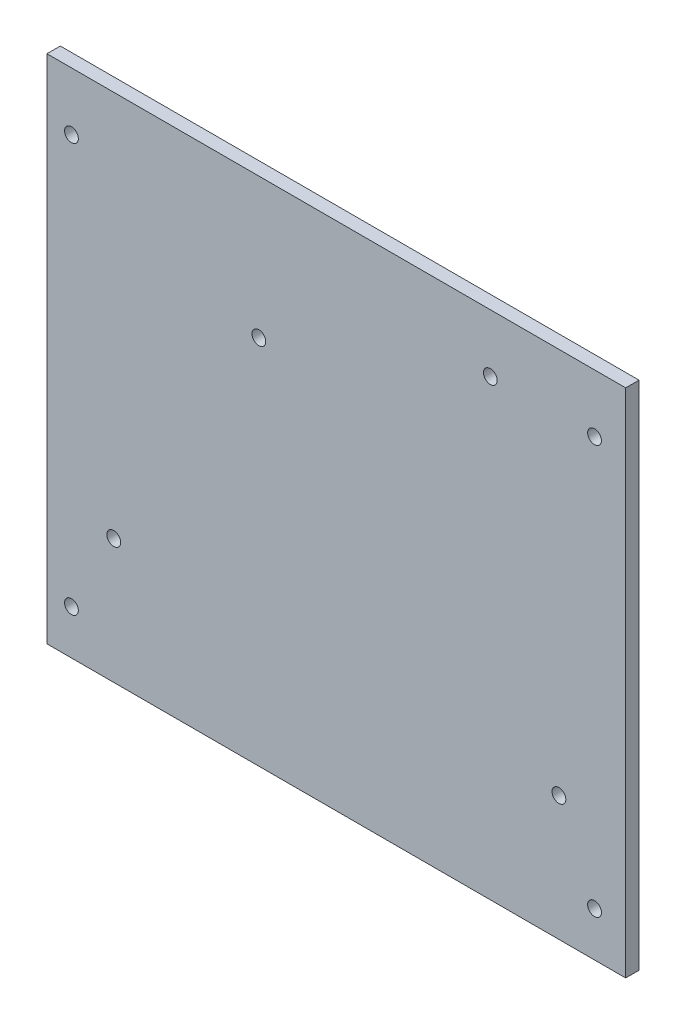
ISO-10303-21;
HEADER;
FILE_DESCRIPTION(('STEP AP214'),'2;1');
FILE_NAME('part.step','',(''),(''),'','','');
FILE_SCHEMA(('AUTOMOTIVE_DESIGN { 1 0 10303 214 1 1 1 1 }'));
ENDSEC;
DATA;
#1=APPLICATION_CONTEXT('core data for automotive mechanical design processes');
#2=APPLICATION_PROTOCOL_DEFINITION('international standard','automotive_design',2000,#1);
#3=PRODUCT_CONTEXT('',#1,'mechanical');
#4=PRODUCT('Part','Part','',(#3));
#5=PRODUCT_RELATED_PRODUCT_CATEGORY('part','',(#4));
#6=PRODUCT_DEFINITION_FORMATION('','',#4);
#7=PRODUCT_DEFINITION_CONTEXT('part definition',#1,'design');
#8=PRODUCT_DEFINITION('design','',#6,#7);
#9=PRODUCT_DEFINITION_SHAPE('','',#8);
#10=(LENGTH_UNIT() NAMED_UNIT(*) SI_UNIT(.MILLI.,.METRE.));
#11=(NAMED_UNIT(*) PLANE_ANGLE_UNIT() SI_UNIT($,.RADIAN.));
#12=(NAMED_UNIT(*) SI_UNIT($,.STERADIAN.) SOLID_ANGLE_UNIT());
#13=UNCERTAINTY_MEASURE_WITH_UNIT(LENGTH_MEASURE(1.E-05),#10,'distance_accuracy_value','');
#14=(GEOMETRIC_REPRESENTATION_CONTEXT(3) GLOBAL_UNCERTAINTY_ASSIGNED_CONTEXT((#13)) GLOBAL_UNIT_ASSIGNED_CONTEXT((#10,
#11,#12)) REPRESENTATION_CONTEXT('',''));
#15=CARTESIAN_POINT('',(0.,0.,0.));
#16=DIRECTION('',(0.,0.,1.));
#17=DIRECTION('',(1.,0.,0.));
#18=AXIS2_PLACEMENT_3D('',#15,#16,#17);
#19=CARTESIAN_POINT('',(0.,0.,3.));
#20=DIRECTION('',(0.,0.,-1.));
#21=DIRECTION('',(-1.,0.,0.));
#22=AXIS2_PLACEMENT_3D('',#19,#20,#21);
#23=PLANE('',#22);
#24=CARTESIAN_POINT('',(34.6,44.4,3.));
#25=DIRECTION('',(0.,0.,-1.));
#26=DIRECTION('',(-1.,0.,0.));
#27=AXIS2_PLACEMENT_3D('',#24,#25,#26);
#28=CIRCLE('',#27,1.55);
#29=CARTESIAN_POINT('',(33.05,44.4,3.));
#30=VERTEX_POINT('',#29);
#31=EDGE_CURVE('E142',#30,#30,#28,.F.);
#32=ORIENTED_EDGE('',*,*,#31,.F.);
#33=EDGE_LOOP('',(#32));
#34=FACE_BOUND('',#33,.T.);
#35=CARTESIAN_POINT('',(-17.4,25.96,3.));
#36=DIRECTION('',(0.,0.,-1.));
#37=DIRECTION('',(-1.,0.,0.));
#38=AXIS2_PLACEMENT_3D('',#35,#36,#37);
#39=CIRCLE('',#38,1.55);
#40=CARTESIAN_POINT('',(-18.95,25.96,3.));
#41=VERTEX_POINT('',#40);
#42=EDGE_CURVE('E147',#41,#41,#39,.F.);
#43=ORIENTED_EDGE('',*,*,#42,.F.);
#44=EDGE_LOOP('',(#43));
#45=FACE_BOUND('',#44,.T.);
#46=CARTESIAN_POINT('',(50.,-29.4,3.));
#47=DIRECTION('',(0.,0.,-1.));
#48=DIRECTION('',(-1.,0.,0.));
#49=AXIS2_PLACEMENT_3D('',#46,#47,#48);
#50=CIRCLE('',#49,1.54999999999999);
#51=CARTESIAN_POINT('',(48.45,-29.4,3.));
#52=VERTEX_POINT('',#51);
#53=EDGE_CURVE('E132',#52,#52,#50,.F.);
#54=ORIENTED_EDGE('',*,*,#53,.F.);
#55=EDGE_LOOP('',(#54));
#56=FACE_BOUND('',#55,.T.);
#57=CARTESIAN_POINT('',(-50.,-29.4,3.));
#58=DIRECTION('',(0.,0.,-1.));
#59=DIRECTION('',(-1.,0.,0.));
#60=AXIS2_PLACEMENT_3D('',#57,#58,#59);
#61=CIRCLE('',#60,1.54999999999999);
#62=CARTESIAN_POINT('',(-51.55,-29.4,3.));
#63=VERTEX_POINT('',#62);
#64=EDGE_CURVE('E135',#63,#63,#61,.F.);
#65=ORIENTED_EDGE('',*,*,#64,.F.);
#66=EDGE_LOOP('',(#65));
#67=FACE_BOUND('',#66,.T.);
#68=DIRECTION('',(0.,1.,0.));
#69=VECTOR('',#68,1.);
#70=CARTESIAN_POINT('',(65.,-57.4,3.));
#71=LINE('',#70,#69);
#72=CARTESIAN_POINT('',(65.,-57.4,3.));
#73=VERTEX_POINT('',#72);
#74=CARTESIAN_POINT('',(65.,57.4,3.));
#75=VERTEX_POINT('',#74);
#76=EDGE_CURVE('E84',#73,#75,#71,.T.);
#77=ORIENTED_EDGE('',*,*,#76,.T.);
#78=DIRECTION('',(-1.,0.,0.));
#79=VECTOR('',#78,1.);
#80=CARTESIAN_POINT('',(-65.,57.4,3.));
#81=LINE('',#80,#79);
#82=CARTESIAN_POINT('',(-65.,57.4,3.));
#83=VERTEX_POINT('',#82);
#84=EDGE_CURVE('E79',#75,#83,#81,.T.);
#85=ORIENTED_EDGE('',*,*,#84,.T.);
#86=DIRECTION('',(0.,-1.,0.));
#87=VECTOR('',#86,1.);
#88=CARTESIAN_POINT('',(-65.,-57.4,3.));
#89=LINE('',#88,#87);
#90=CARTESIAN_POINT('',(-65.,-57.4,3.));
#91=VERTEX_POINT('',#90);
#92=EDGE_CURVE('E82',#83,#91,#89,.T.);
#93=ORIENTED_EDGE('',*,*,#92,.T.);
#94=DIRECTION('',(1.,0.,0.));
#95=VECTOR('',#94,1.);
#96=CARTESIAN_POINT('',(-65.,-57.4,3.));
#97=LINE('',#96,#95);
#98=EDGE_CURVE('E49',#91,#73,#97,.T.);
#99=ORIENTED_EDGE('',*,*,#98,.T.);
#100=EDGE_LOOP('',(#77,#85,#93,#99));
#101=FACE_BOUND('',#100,.T.);
#102=CARTESIAN_POINT('',(-59.5,44.4,3.));
#103=DIRECTION('',(0.,0.,1.));
#104=DIRECTION('',(1.,0.,0.));
#105=AXIS2_PLACEMENT_3D('',#102,#103,#104);
#106=CIRCLE('',#105,1.55);
#107=CARTESIAN_POINT('',(-57.95,44.4,3.));
#108=VERTEX_POINT('',#107);
#109=EDGE_CURVE('E99',#108,#108,#106,.T.);
#110=ORIENTED_EDGE('',*,*,#109,.F.);
#111=EDGE_LOOP('',(#110));
#112=FACE_BOUND('',#111,.T.);
#113=CARTESIAN_POINT('',(58.,44.4,3.));
#114=DIRECTION('',(0.,0.,1.));
#115=DIRECTION('',(1.,0.,0.));
#116=AXIS2_PLACEMENT_3D('',#113,#114,#115);
#117=CIRCLE('',#116,1.55);
#118=CARTESIAN_POINT('',(59.55,44.4,3.));
#119=VERTEX_POINT('',#118);
#120=EDGE_CURVE('E114',#119,#119,#117,.T.);
#121=ORIENTED_EDGE('',*,*,#120,.F.);
#122=EDGE_LOOP('',(#121));
#123=FACE_BOUND('',#122,.T.);
#124=CARTESIAN_POINT('',(58.,-47.4,3.));
#125=DIRECTION('',(0.,0.,1.));
#126=DIRECTION('',(1.,0.,0.));
#127=AXIS2_PLACEMENT_3D('',#124,#125,#126);
#128=CIRCLE('',#127,1.55);
#129=CARTESIAN_POINT('',(59.55,-47.4,3.));
#130=VERTEX_POINT('',#129);
#131=EDGE_CURVE('E120',#130,#130,#128,.T.);
#132=ORIENTED_EDGE('',*,*,#131,.F.);
#133=EDGE_LOOP('',(#132));
#134=FACE_BOUND('',#133,.T.);
#135=CARTESIAN_POINT('',(-59.5,-47.4,3.));
#136=DIRECTION('',(0.,0.,1.));
#137=DIRECTION('',(1.,0.,0.));
#138=AXIS2_PLACEMENT_3D('',#135,#136,#137);
#139=CIRCLE('',#138,1.55);
#140=CARTESIAN_POINT('',(-57.95,-47.4,3.));
#141=VERTEX_POINT('',#140);
#142=EDGE_CURVE('E126',#141,#141,#139,.T.);
#143=ORIENTED_EDGE('',*,*,#142,.F.);
#144=EDGE_LOOP('',(#143));
#145=FACE_BOUND('',#144,.T.);
#146=ADVANCED_FACE('F32',(#34,#45,#56,#67,#101,#112,#123,#134,#145),#23,.F.);
#147=CARTESIAN_POINT('',(0.,0.,0.));
#148=DIRECTION('',(0.,0.,-1.));
#149=DIRECTION('',(-1.,0.,0.));
#150=AXIS2_PLACEMENT_3D('',#147,#148,#149);
#151=PLANE('',#150);
#152=CARTESIAN_POINT('',(34.6,44.4,0.));
#153=DIRECTION('',(0.,0.,-1.));
#154=DIRECTION('',(-1.,0.,0.));
#155=AXIS2_PLACEMENT_3D('',#152,#153,#154);
#156=CIRCLE('',#155,1.55);
#157=CARTESIAN_POINT('',(33.05,44.4,0.));
#158=VERTEX_POINT('',#157);
#159=EDGE_CURVE('E150',#158,#158,#156,.T.);
#160=ORIENTED_EDGE('',*,*,#159,.F.);
#161=EDGE_LOOP('',(#160));
#162=FACE_BOUND('',#161,.T.);
#163=CARTESIAN_POINT('',(-17.4,25.96,0.));
#164=DIRECTION('',(0.,0.,-1.));
#165=DIRECTION('',(-1.,0.,0.));
#166=AXIS2_PLACEMENT_3D('',#163,#164,#165);
#167=CIRCLE('',#166,1.55);
#168=CARTESIAN_POINT('',(-18.95,25.96,0.));
#169=VERTEX_POINT('',#168);
#170=EDGE_CURVE('E151',#169,#169,#167,.T.);
#171=ORIENTED_EDGE('',*,*,#170,.F.);
#172=EDGE_LOOP('',(#171));
#173=FACE_BOUND('',#172,.T.);
#174=CARTESIAN_POINT('',(50.,-29.4,0.));
#175=DIRECTION('',(0.,0.,-1.));
#176=DIRECTION('',(-1.,0.,0.));
#177=AXIS2_PLACEMENT_3D('',#174,#175,#176);
#178=CIRCLE('',#177,1.54999999999999);
#179=CARTESIAN_POINT('',(48.45,-29.4,0.));
#180=VERTEX_POINT('',#179);
#181=EDGE_CURVE('E138',#180,#180,#178,.T.);
#182=ORIENTED_EDGE('',*,*,#181,.F.);
#183=EDGE_LOOP('',(#182));
#184=FACE_BOUND('',#183,.T.);
#185=CARTESIAN_POINT('',(-50.,-29.4,0.));
#186=DIRECTION('',(0.,0.,-1.));
#187=DIRECTION('',(-1.,0.,0.));
#188=AXIS2_PLACEMENT_3D('',#185,#186,#187);
#189=CIRCLE('',#188,1.54999999999999);
#190=CARTESIAN_POINT('',(-51.55,-29.4,0.));
#191=VERTEX_POINT('',#190);
#192=EDGE_CURVE('E139',#191,#191,#189,.T.);
#193=ORIENTED_EDGE('',*,*,#192,.F.);
#194=EDGE_LOOP('',(#193));
#195=FACE_BOUND('',#194,.T.);
#196=CARTESIAN_POINT('',(58.,-47.4,0.));
#197=DIRECTION('',(0.,0.,1.));
#198=DIRECTION('',(1.,0.,0.));
#199=AXIS2_PLACEMENT_3D('',#196,#197,#198);
#200=CIRCLE('',#199,1.55);
#201=CARTESIAN_POINT('',(59.55,-47.4,0.));
#202=VERTEX_POINT('',#201);
#203=EDGE_CURVE('E123',#202,#202,#200,.T.);
#204=ORIENTED_EDGE('',*,*,#203,.T.);
#205=EDGE_LOOP('',(#204));
#206=FACE_BOUND('',#205,.T.);
#207=CARTESIAN_POINT('',(-59.5,44.4,0.));
#208=DIRECTION('',(0.,0.,1.));
#209=DIRECTION('',(1.,0.,0.));
#210=AXIS2_PLACEMENT_3D('',#207,#208,#209);
#211=CIRCLE('',#210,1.55);
#212=CARTESIAN_POINT('',(-57.95,44.4,0.));
#213=VERTEX_POINT('',#212);
#214=EDGE_CURVE('E111',#213,#213,#211,.T.);
#215=ORIENTED_EDGE('',*,*,#214,.T.);
#216=EDGE_LOOP('',(#215));
#217=FACE_BOUND('',#216,.T.);
#218=DIRECTION('',(0.,1.,0.));
#219=VECTOR('',#218,1.);
#220=CARTESIAN_POINT('',(65.,-57.4,0.));
#221=LINE('',#220,#219);
#222=CARTESIAN_POINT('',(65.,-57.4,0.));
#223=VERTEX_POINT('',#222);
#224=CARTESIAN_POINT('',(65.,57.4,0.));
#225=VERTEX_POINT('',#224);
#226=EDGE_CURVE('E96',#223,#225,#221,.T.);
#227=ORIENTED_EDGE('',*,*,#226,.F.);
#228=DIRECTION('',(1.,0.,0.));
#229=VECTOR('',#228,1.);
#230=CARTESIAN_POINT('',(-65.,-57.4,0.));
#231=LINE('',#230,#229);
#232=CARTESIAN_POINT('',(-65.,-57.4,0.));
#233=VERTEX_POINT('',#232);
#234=EDGE_CURVE('E72',#233,#223,#231,.T.);
#235=ORIENTED_EDGE('',*,*,#234,.F.);
#236=DIRECTION('',(0.,-1.,0.));
#237=VECTOR('',#236,1.);
#238=CARTESIAN_POINT('',(-65.,-57.4,0.));
#239=LINE('',#238,#237);
#240=CARTESIAN_POINT('',(-65.,57.4,0.));
#241=VERTEX_POINT('',#240);
#242=EDGE_CURVE('E66',#241,#233,#239,.T.);
#243=ORIENTED_EDGE('',*,*,#242,.F.);
#244=DIRECTION('',(-1.,0.,0.));
#245=VECTOR('',#244,1.);
#246=CARTESIAN_POINT('',(-65.,57.4,0.));
#247=LINE('',#246,#245);
#248=EDGE_CURVE('E88',#225,#241,#247,.T.);
#249=ORIENTED_EDGE('',*,*,#248,.F.);
#250=EDGE_LOOP('',(#227,#235,#243,#249));
#251=FACE_BOUND('',#250,.T.);
#252=CARTESIAN_POINT('',(58.,44.4,0.));
#253=DIRECTION('',(0.,0.,1.));
#254=DIRECTION('',(1.,0.,0.));
#255=AXIS2_PLACEMENT_3D('',#252,#253,#254);
#256=CIRCLE('',#255,1.55);
#257=CARTESIAN_POINT('',(59.55,44.4,0.));
#258=VERTEX_POINT('',#257);
#259=EDGE_CURVE('E117',#258,#258,#256,.T.);
#260=ORIENTED_EDGE('',*,*,#259,.T.);
#261=EDGE_LOOP('',(#260));
#262=FACE_BOUND('',#261,.T.);
#263=CARTESIAN_POINT('',(-59.5,-47.4,0.));
#264=DIRECTION('',(0.,0.,1.));
#265=DIRECTION('',(1.,0.,0.));
#266=AXIS2_PLACEMENT_3D('',#263,#264,#265);
#267=CIRCLE('',#266,1.55);
#268=CARTESIAN_POINT('',(-57.95,-47.4,0.));
#269=VERTEX_POINT('',#268);
#270=EDGE_CURVE('E129',#269,#269,#267,.T.);
#271=ORIENTED_EDGE('',*,*,#270,.T.);
#272=EDGE_LOOP('',(#271));
#273=FACE_BOUND('',#272,.T.);
#274=ADVANCED_FACE('F107',(#162,#173,#184,#195,#206,#217,#251,#262,#273),#151,.T.);
#275=CARTESIAN_POINT('',(65.,-57.4,3.));
#276=DIRECTION('',(-1.,0.,0.));
#277=DIRECTION('',(0.,0.,1.));
#278=AXIS2_PLACEMENT_3D('',#275,#276,#277);
#279=PLANE('',#278);
#280=ORIENTED_EDGE('',*,*,#226,.T.);
#281=DIRECTION('',(0.,0.,-1.));
#282=VECTOR('',#281,1.);
#283=CARTESIAN_POINT('',(65.,57.4,3.));
#284=LINE('',#283,#282);
#285=EDGE_CURVE('E11',#75,#225,#284,.T.);
#286=ORIENTED_EDGE('',*,*,#285,.F.);
#287=ORIENTED_EDGE('',*,*,#76,.F.);
#288=DIRECTION('',(0.,0.,-1.));
#289=VECTOR('',#288,1.);
#290=CARTESIAN_POINT('',(65.,-57.4,3.));
#291=LINE('',#290,#289);
#292=EDGE_CURVE('E92',#73,#223,#291,.T.);
#293=ORIENTED_EDGE('',*,*,#292,.T.);
#294=EDGE_LOOP('',(#280,#286,#287,#293));
#295=FACE_BOUND('',#294,.T.);
#296=ADVANCED_FACE('F34',(#295),#279,.F.);
#297=CARTESIAN_POINT('',(-65.,57.4,3.));
#298=DIRECTION('',(0.,-1.,0.));
#299=DIRECTION('',(0.,0.,-1.));
#300=AXIS2_PLACEMENT_3D('',#297,#298,#299);
#301=PLANE('',#300);
#302=ORIENTED_EDGE('',*,*,#248,.T.);
#303=DIRECTION('',(0.,0.,-1.));
#304=VECTOR('',#303,1.);
#305=CARTESIAN_POINT('',(-65.,57.4,3.));
#306=LINE('',#305,#304);
#307=EDGE_CURVE('E41',#83,#241,#306,.T.);
#308=ORIENTED_EDGE('',*,*,#307,.F.);
#309=ORIENTED_EDGE('',*,*,#84,.F.);
#310=ORIENTED_EDGE('',*,*,#285,.T.);
#311=EDGE_LOOP('',(#302,#308,#309,#310));
#312=FACE_BOUND('',#311,.T.);
#313=ADVANCED_FACE('F87',(#312),#301,.F.);
#314=CARTESIAN_POINT('',(-65.,-57.4,3.));
#315=DIRECTION('',(1.,0.,0.));
#316=DIRECTION('',(0.,0.,-1.));
#317=AXIS2_PLACEMENT_3D('',#314,#315,#316);
#318=PLANE('',#317);
#319=ORIENTED_EDGE('',*,*,#242,.T.);
#320=DIRECTION('',(0.,0.,-1.));
#321=VECTOR('',#320,1.);
#322=CARTESIAN_POINT('',(-65.,-57.4,3.));
#323=LINE('',#322,#321);
#324=EDGE_CURVE('E89',#91,#233,#323,.T.);
#325=ORIENTED_EDGE('',*,*,#324,.F.);
#326=ORIENTED_EDGE('',*,*,#92,.F.);
#327=ORIENTED_EDGE('',*,*,#307,.T.);
#328=EDGE_LOOP('',(#319,#325,#326,#327));
#329=FACE_BOUND('',#328,.T.);
#330=ADVANCED_FACE('F90',(#329),#318,.F.);
#331=CARTESIAN_POINT('',(-65.,-57.4,3.));
#332=DIRECTION('',(0.,1.,0.));
#333=DIRECTION('',(0.,0.,1.));
#334=AXIS2_PLACEMENT_3D('',#331,#332,#333);
#335=PLANE('',#334);
#336=ORIENTED_EDGE('',*,*,#234,.T.);
#337=ORIENTED_EDGE('',*,*,#292,.F.);
#338=ORIENTED_EDGE('',*,*,#98,.F.);
#339=ORIENTED_EDGE('',*,*,#324,.T.);
#340=EDGE_LOOP('',(#336,#337,#338,#339));
#341=FACE_BOUND('',#340,.T.);
#342=ADVANCED_FACE('F104',(#341),#335,.F.);
#343=CARTESIAN_POINT('',(-59.5,44.4,3.));
#344=DIRECTION('',(0.,0.,-1.));
#345=DIRECTION('',(-1.,0.,0.));
#346=AXIS2_PLACEMENT_3D('',#343,#344,#345);
#347=CYLINDRICAL_SURFACE('',#346,1.55);
#348=ORIENTED_EDGE('',*,*,#109,.T.);
#349=EDGE_LOOP('',(#348));
#350=FACE_BOUND('',#349,.T.);
#351=ORIENTED_EDGE('',*,*,#214,.F.);
#352=EDGE_LOOP('',(#351));
#353=FACE_BOUND('',#352,.T.);
#354=ADVANCED_FACE('F175',(#350,#353),#347,.F.);
#355=CARTESIAN_POINT('',(58.,44.4,3.));
#356=DIRECTION('',(0.,0.,-1.));
#357=DIRECTION('',(-1.,0.,0.));
#358=AXIS2_PLACEMENT_3D('',#355,#356,#357);
#359=CYLINDRICAL_SURFACE('',#358,1.55);
#360=ORIENTED_EDGE('',*,*,#120,.T.);
#361=EDGE_LOOP('',(#360));
#362=FACE_BOUND('',#361,.T.);
#363=ORIENTED_EDGE('',*,*,#259,.F.);
#364=EDGE_LOOP('',(#363));
#365=FACE_BOUND('',#364,.T.);
#366=ADVANCED_FACE('F177',(#362,#365),#359,.F.);
#367=CARTESIAN_POINT('',(58.,-47.4,3.));
#368=DIRECTION('',(0.,0.,-1.));
#369=DIRECTION('',(-1.,0.,0.));
#370=AXIS2_PLACEMENT_3D('',#367,#368,#369);
#371=CYLINDRICAL_SURFACE('',#370,1.55);
#372=ORIENTED_EDGE('',*,*,#131,.T.);
#373=EDGE_LOOP('',(#372));
#374=FACE_BOUND('',#373,.T.);
#375=ORIENTED_EDGE('',*,*,#203,.F.);
#376=EDGE_LOOP('',(#375));
#377=FACE_BOUND('',#376,.T.);
#378=ADVANCED_FACE('F184',(#374,#377),#371,.F.);
#379=CARTESIAN_POINT('',(-59.5,-47.4,3.));
#380=DIRECTION('',(0.,0.,-1.));
#381=DIRECTION('',(-1.,0.,0.));
#382=AXIS2_PLACEMENT_3D('',#379,#380,#381);
#383=CYLINDRICAL_SURFACE('',#382,1.55);
#384=ORIENTED_EDGE('',*,*,#142,.T.);
#385=EDGE_LOOP('',(#384));
#386=FACE_BOUND('',#385,.T.);
#387=ORIENTED_EDGE('',*,*,#270,.F.);
#388=EDGE_LOOP('',(#387));
#389=FACE_BOUND('',#388,.T.);
#390=ADVANCED_FACE('F241',(#386,#389),#383,.F.);
#391=CARTESIAN_POINT('',(-50.,-29.4,3.001));
#392=DIRECTION('',(0.,0.,-1.));
#393=DIRECTION('',(-1.,0.,0.));
#394=AXIS2_PLACEMENT_3D('',#391,#392,#393);
#395=CYLINDRICAL_SURFACE('',#394,1.54999999999999);
#396=ORIENTED_EDGE('',*,*,#192,.T.);
#397=EDGE_LOOP('',(#396));
#398=FACE_BOUND('',#397,.T.);
#399=ORIENTED_EDGE('',*,*,#64,.T.);
#400=EDGE_LOOP('',(#399));
#401=FACE_BOUND('',#400,.T.);
#402=ADVANCED_FACE('F237',(#398,#401),#395,.F.);
#403=CARTESIAN_POINT('',(50.,-29.4,3.001));
#404=DIRECTION('',(0.,0.,-1.));
#405=DIRECTION('',(-1.,0.,0.));
#406=AXIS2_PLACEMENT_3D('',#403,#404,#405);
#407=CYLINDRICAL_SURFACE('',#406,1.54999999999999);
#408=ORIENTED_EDGE('',*,*,#181,.T.);
#409=EDGE_LOOP('',(#408));
#410=FACE_BOUND('',#409,.T.);
#411=ORIENTED_EDGE('',*,*,#53,.T.);
#412=EDGE_LOOP('',(#411));
#413=FACE_BOUND('',#412,.T.);
#414=ADVANCED_FACE('F220',(#410,#413),#407,.F.);
#415=CARTESIAN_POINT('',(-17.4,25.96,3.001));
#416=DIRECTION('',(0.,0.,-1.));
#417=DIRECTION('',(-1.,0.,0.));
#418=AXIS2_PLACEMENT_3D('',#415,#416,#417);
#419=CYLINDRICAL_SURFACE('',#418,1.55);
#420=ORIENTED_EDGE('',*,*,#170,.T.);
#421=EDGE_LOOP('',(#420));
#422=FACE_BOUND('',#421,.T.);
#423=ORIENTED_EDGE('',*,*,#42,.T.);
#424=EDGE_LOOP('',(#423));
#425=FACE_BOUND('',#424,.T.);
#426=ADVANCED_FACE('F215',(#422,#425),#419,.F.);
#427=CARTESIAN_POINT('',(34.6,44.4,3.001));
#428=DIRECTION('',(0.,0.,-1.));
#429=DIRECTION('',(-1.,0.,0.));
#430=AXIS2_PLACEMENT_3D('',#427,#428,#429);
#431=CYLINDRICAL_SURFACE('',#430,1.55);
#432=ORIENTED_EDGE('',*,*,#159,.T.);
#433=EDGE_LOOP('',(#432));
#434=FACE_BOUND('',#433,.T.);
#435=ORIENTED_EDGE('',*,*,#31,.T.);
#436=EDGE_LOOP('',(#435));
#437=FACE_BOUND('',#436,.T.);
#438=ADVANCED_FACE('F159',(#434,#437),#431,.F.);
#439=CLOSED_SHELL('',(#146,#274,#296,#313,#330,#342,#354,#366,#378,#390,#402,#414,#426,#438));
#440=MANIFOLD_SOLID_BREP('B2',#439);
#441=ADVANCED_BREP_SHAPE_REPRESENTATION('',(#18,#440),#14);
#442=SHAPE_DEFINITION_REPRESENTATION(#9,#441);
ENDSEC;
END-ISO-10303-21;
